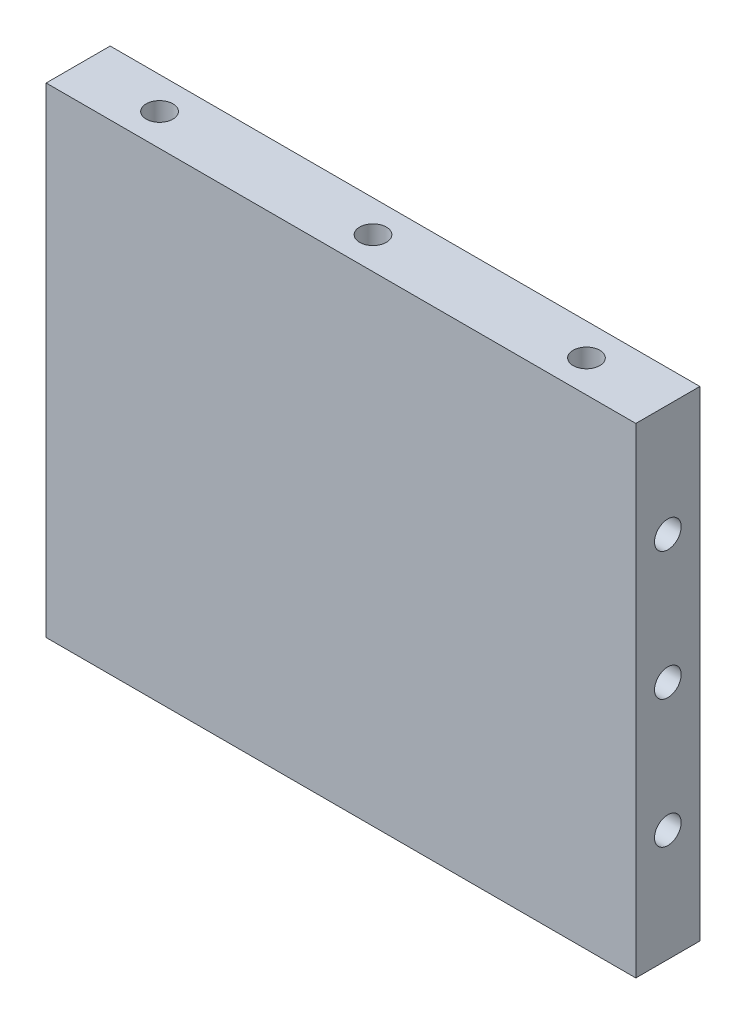
ISO-10303-21;
HEADER;
FILE_DESCRIPTION(('STEP AP214'),'2;1');
FILE_NAME('part.step','',(''),(''),'','','');
FILE_SCHEMA(('AUTOMOTIVE_DESIGN { 1 0 10303 214 1 1 1 1 }'));
ENDSEC;
DATA;
#1=APPLICATION_CONTEXT('core data for automotive mechanical design processes');
#2=APPLICATION_PROTOCOL_DEFINITION('international standard','automotive_design',2000,#1);
#3=PRODUCT_CONTEXT('',#1,'mechanical');
#4=PRODUCT('Part','Part','',(#3));
#5=PRODUCT_RELATED_PRODUCT_CATEGORY('part','',(#4));
#6=PRODUCT_DEFINITION_FORMATION('','',#4);
#7=PRODUCT_DEFINITION_CONTEXT('part definition',#1,'design');
#8=PRODUCT_DEFINITION('design','',#6,#7);
#9=PRODUCT_DEFINITION_SHAPE('','',#8);
#10=(LENGTH_UNIT() NAMED_UNIT(*) SI_UNIT(.MILLI.,.METRE.));
#11=(NAMED_UNIT(*) PLANE_ANGLE_UNIT() SI_UNIT($,.RADIAN.));
#12=(NAMED_UNIT(*) SI_UNIT($,.STERADIAN.) SOLID_ANGLE_UNIT());
#13=UNCERTAINTY_MEASURE_WITH_UNIT(LENGTH_MEASURE(1.E-05),#10,'distance_accuracy_value','');
#14=(GEOMETRIC_REPRESENTATION_CONTEXT(3) GLOBAL_UNCERTAINTY_ASSIGNED_CONTEXT((#13)) GLOBAL_UNIT_ASSIGNED_CONTEXT((#10,
#11,#12)) REPRESENTATION_CONTEXT('',''));
#15=CARTESIAN_POINT('',(0.,0.,0.));
#16=DIRECTION('',(0.,0.,1.));
#17=DIRECTION('',(1.,0.,0.));
#18=AXIS2_PLACEMENT_3D('',#15,#16,#17);
#19=CARTESIAN_POINT('',(20.,22.5,3.));
#20=DIRECTION('',(0.,1.,0.));
#21=DIRECTION('',(0.,0.,1.));
#22=AXIS2_PLACEMENT_3D('',#19,#20,#21);
#23=CYLINDRICAL_SURFACE('',#22,1.24999999999999);
#24=CARTESIAN_POINT('',(20.,22.5,3.));
#25=DIRECTION('',(0.,1.,0.));
#26=DIRECTION('',(0.,0.,1.));
#27=AXIS2_PLACEMENT_3D('',#24,#25,#26);
#28=CIRCLE('',#27,1.25);
#29=CARTESIAN_POINT('',(20.,22.5,4.25));
#30=VERTEX_POINT('',#29);
#31=EDGE_CURVE('E240',#30,#30,#28,.T.);
#32=ORIENTED_EDGE('',*,*,#31,.T.);
#33=EDGE_LOOP('',(#32));
#34=FACE_BOUND('',#33,.T.);
#35=CARTESIAN_POINT('',(20.,12.,3.));
#36=DIRECTION('',(0.707106781186547,0.707106781186547,0.));
#37=DIRECTION('',(-0.707106781186547,0.707106781186547,0.));
#38=AXIS2_PLACEMENT_3D('',#35,#36,#37);
#39=ELLIPSE('',#38,1.76776695296636,1.24999999999999);
#40=CARTESIAN_POINT('',(20.,12.,4.24999999999999));
#41=VERTEX_POINT('',#40);
#42=CARTESIAN_POINT('',(20.,12.,1.75000000000001));
#43=VERTEX_POINT('',#42);
#44=EDGE_CURVE('E60',#41,#43,#39,.F.);
#45=ORIENTED_EDGE('',*,*,#44,.T.);
#46=CARTESIAN_POINT('',(20.,12.,3.));
#47=DIRECTION('',(-0.707106781186547,0.707106781186547,0.));
#48=DIRECTION('',(0.707106781186547,0.707106781186547,0.));
#49=AXIS2_PLACEMENT_3D('',#46,#47,#48);
#50=ELLIPSE('',#49,1.76776695296636,1.24999999999999);
#51=EDGE_CURVE('E336',#43,#41,#50,.F.);
#52=ORIENTED_EDGE('',*,*,#51,.T.);
#53=EDGE_LOOP('',(#45,#52));
#54=FACE_BOUND('',#53,.T.);
#55=ADVANCED_FACE('F45',(#34,#54),#23,.F.);
#56=CARTESIAN_POINT('',(-20.,22.5,3.));
#57=DIRECTION('',(0.,1.,0.));
#58=DIRECTION('',(0.,0.,1.));
#59=AXIS2_PLACEMENT_3D('',#56,#57,#58);
#60=CYLINDRICAL_SURFACE('',#59,1.24999999999999);
#61=CARTESIAN_POINT('',(-20.,22.5,3.));
#62=DIRECTION('',(0.,1.,0.));
#63=DIRECTION('',(0.,0.,1.));
#64=AXIS2_PLACEMENT_3D('',#61,#62,#63);
#65=CIRCLE('',#64,1.25);
#66=CARTESIAN_POINT('',(-20.,22.5,4.25));
#67=VERTEX_POINT('',#66);
#68=EDGE_CURVE('E256',#67,#67,#65,.T.);
#69=ORIENTED_EDGE('',*,*,#68,.T.);
#70=EDGE_LOOP('',(#69));
#71=FACE_BOUND('',#70,.T.);
#72=CARTESIAN_POINT('',(-20.,12.,3.));
#73=DIRECTION('',(0.707106781186547,0.707106781186547,0.));
#74=DIRECTION('',(-0.707106781186547,0.707106781186547,0.));
#75=AXIS2_PLACEMENT_3D('',#72,#73,#74);
#76=ELLIPSE('',#75,1.76776695296636,1.24999999999999);
#77=CARTESIAN_POINT('',(-20.,12.,4.24999999999999));
#78=VERTEX_POINT('',#77);
#79=CARTESIAN_POINT('',(-20.,12.,1.75000000000001));
#80=VERTEX_POINT('',#79);
#81=EDGE_CURVE('E67',#78,#80,#76,.F.);
#82=ORIENTED_EDGE('',*,*,#81,.T.);
#83=CARTESIAN_POINT('',(-20.,12.,3.));
#84=DIRECTION('',(-0.707106781186547,0.707106781186547,0.));
#85=DIRECTION('',(0.707106781186547,0.707106781186547,0.));
#86=AXIS2_PLACEMENT_3D('',#83,#84,#85);
#87=ELLIPSE('',#86,1.76776695296636,1.24999999999999);
#88=EDGE_CURVE('E349',#80,#78,#87,.F.);
#89=ORIENTED_EDGE('',*,*,#88,.T.);
#90=EDGE_LOOP('',(#82,#89));
#91=FACE_BOUND('',#90,.T.);
#92=ADVANCED_FACE('F411',(#71,#91),#60,.F.);
#93=CARTESIAN_POINT('',(0.,22.5,3.));
#94=DIRECTION('',(0.,1.,0.));
#95=DIRECTION('',(0.,0.,1.));
#96=AXIS2_PLACEMENT_3D('',#93,#94,#95);
#97=CYLINDRICAL_SURFACE('',#96,1.24999999999999);
#98=CARTESIAN_POINT('',(0.,22.5,3.));
#99=DIRECTION('',(0.,1.,0.));
#100=DIRECTION('',(0.,0.,1.));
#101=AXIS2_PLACEMENT_3D('',#98,#99,#100);
#102=CIRCLE('',#101,1.25);
#103=CARTESIAN_POINT('',(0.,22.5,4.25));
#104=VERTEX_POINT('',#103);
#105=EDGE_CURVE('E248',#104,#104,#102,.T.);
#106=ORIENTED_EDGE('',*,*,#105,.T.);
#107=EDGE_LOOP('',(#106));
#108=FACE_BOUND('',#107,.T.);
#109=CARTESIAN_POINT('',(0.,12.,3.));
#110=DIRECTION('',(0.707106781186547,0.707106781186547,0.));
#111=DIRECTION('',(-0.707106781186547,0.707106781186547,0.));
#112=AXIS2_PLACEMENT_3D('',#109,#110,#111);
#113=ELLIPSE('',#112,1.76776695296636,1.24999999999999);
#114=CARTESIAN_POINT('',(0.,12.,4.24999999999999));
#115=VERTEX_POINT('',#114);
#116=CARTESIAN_POINT('',(0.,12.,1.75000000000001));
#117=VERTEX_POINT('',#116);
#118=EDGE_CURVE('E150',#115,#117,#113,.F.);
#119=ORIENTED_EDGE('',*,*,#118,.T.);
#120=CARTESIAN_POINT('',(0.,12.,3.));
#121=DIRECTION('',(-0.707106781186547,0.707106781186547,0.));
#122=DIRECTION('',(0.707106781186547,0.707106781186547,0.));
#123=AXIS2_PLACEMENT_3D('',#120,#121,#122);
#124=ELLIPSE('',#123,1.76776695296636,1.24999999999999);
#125=EDGE_CURVE('E11',#117,#115,#124,.F.);
#126=ORIENTED_EDGE('',*,*,#125,.T.);
#127=EDGE_LOOP('',(#119,#126));
#128=FACE_BOUND('',#127,.T.);
#129=ADVANCED_FACE('F160',(#108,#128),#97,.F.);
#130=CARTESIAN_POINT('',(0.,0.,2.99999999999648));
#131=DIRECTION('',(0.707106781186547,0.707106781186547,0.));
#132=DIRECTION('',(-0.707106781186547,0.707106781186547,0.));
#133=AXIS2_PLACEMENT_3D('',#130,#131,#132);
#134=ELLIPSE('',#133,1.76776695296636,1.24999999999999);
#135=CARTESIAN_POINT('',(0.,0.,4.24999999999647));
#136=VERTEX_POINT('',#135);
#137=CARTESIAN_POINT('',(0.,0.,1.74999999999649));
#138=VERTEX_POINT('',#137);
#139=EDGE_CURVE('E268',#136,#138,#134,.T.);
#140=ORIENTED_EDGE('',*,*,#139,.T.);
#141=CARTESIAN_POINT('',(0.,0.,2.99999999999648));
#142=DIRECTION('',(-0.707106781186547,0.707106781186547,0.));
#143=DIRECTION('',(0.707106781186547,0.707106781186547,0.));
#144=AXIS2_PLACEMENT_3D('',#141,#142,#143);
#145=ELLIPSE('',#144,1.76776695296636,1.24999999999999);
#146=EDGE_CURVE('E264',#138,#136,#145,.T.);
#147=ORIENTED_EDGE('',*,*,#146,.T.);
#148=EDGE_LOOP('',(#140,#147));
#149=FACE_BOUND('',#148,.T.);
#150=CARTESIAN_POINT('',(0.,-12.,3.));
#151=DIRECTION('',(0.707106781186547,0.707106781186547,0.));
#152=DIRECTION('',(-0.707106781186547,0.707106781186547,0.));
#153=AXIS2_PLACEMENT_3D('',#150,#151,#152);
#154=ELLIPSE('',#153,1.76776695296636,1.24999999999999);
#155=CARTESIAN_POINT('',(0.,-12.,4.24999999999999));
#156=VERTEX_POINT('',#155);
#157=CARTESIAN_POINT('',(0.,-12.,1.75000000000001));
#158=VERTEX_POINT('',#157);
#159=EDGE_CURVE('E310',#156,#158,#154,.F.);
#160=ORIENTED_EDGE('',*,*,#159,.T.);
#161=CARTESIAN_POINT('',(0.,-12.,3.));
#162=DIRECTION('',(-0.707106781186547,0.707106781186547,0.));
#163=DIRECTION('',(0.707106781186547,0.707106781186547,0.));
#164=AXIS2_PLACEMENT_3D('',#161,#162,#163);
#165=ELLIPSE('',#164,1.76776695296636,1.24999999999999);
#166=EDGE_CURVE('E298',#158,#156,#165,.F.);
#167=ORIENTED_EDGE('',*,*,#166,.T.);
#168=EDGE_LOOP('',(#160,#167));
#169=FACE_BOUND('',#168,.T.);
#170=ADVANCED_FACE('F445',(#149,#169),#97,.F.);
#171=CARTESIAN_POINT('',(-20.,0.,2.99999999999648));
#172=DIRECTION('',(0.707106781186547,0.707106781186547,0.));
#173=DIRECTION('',(-0.707106781186547,0.707106781186547,0.));
#174=AXIS2_PLACEMENT_3D('',#171,#172,#173);
#175=ELLIPSE('',#174,1.76776695296636,1.24999999999999);
#176=CARTESIAN_POINT('',(-20.,0.,4.24999999999647));
#177=VERTEX_POINT('',#176);
#178=CARTESIAN_POINT('',(-20.,0.,1.74999999999649));
#179=VERTEX_POINT('',#178);
#180=EDGE_CURVE('E187',#177,#179,#175,.T.);
#181=ORIENTED_EDGE('',*,*,#180,.T.);
#182=CARTESIAN_POINT('',(-20.,0.,2.99999999999648));
#183=DIRECTION('',(-0.707106781186547,0.707106781186547,0.));
#184=DIRECTION('',(0.707106781186547,0.707106781186547,0.));
#185=AXIS2_PLACEMENT_3D('',#182,#183,#184);
#186=ELLIPSE('',#185,1.76776695296636,1.24999999999999);
#187=EDGE_CURVE('E183',#179,#177,#186,.T.);
#188=ORIENTED_EDGE('',*,*,#187,.T.);
#189=EDGE_LOOP('',(#181,#188));
#190=FACE_BOUND('',#189,.T.);
#191=CARTESIAN_POINT('',(-20.,-12.,3.));
#192=DIRECTION('',(0.707106781186547,0.707106781186547,0.));
#193=DIRECTION('',(-0.707106781186547,0.707106781186547,0.));
#194=AXIS2_PLACEMENT_3D('',#191,#192,#193);
#195=ELLIPSE('',#194,1.76776695296636,1.24999999999999);
#196=CARTESIAN_POINT('',(-20.,-12.,4.24999999999999));
#197=VERTEX_POINT('',#196);
#198=CARTESIAN_POINT('',(-20.,-12.,1.75000000000001));
#199=VERTEX_POINT('',#198);
#200=EDGE_CURVE('E325',#197,#199,#195,.F.);
#201=ORIENTED_EDGE('',*,*,#200,.T.);
#202=CARTESIAN_POINT('',(-20.,-12.,3.));
#203=DIRECTION('',(-0.707106781186547,0.707106781186547,0.));
#204=DIRECTION('',(0.707106781186547,0.707106781186547,0.));
#205=AXIS2_PLACEMENT_3D('',#202,#203,#204);
#206=ELLIPSE('',#205,1.76776695296636,1.24999999999999);
#207=EDGE_CURVE('E313',#199,#197,#206,.F.);
#208=ORIENTED_EDGE('',*,*,#207,.T.);
#209=EDGE_LOOP('',(#201,#208));
#210=FACE_BOUND('',#209,.T.);
#211=ADVANCED_FACE('F421',(#190,#210),#60,.F.);
#212=CARTESIAN_POINT('',(20.,0.,2.99999999999648));
#213=DIRECTION('',(0.707106781186547,0.707106781186547,0.));
#214=DIRECTION('',(-0.707106781186547,0.707106781186547,0.));
#215=AXIS2_PLACEMENT_3D('',#212,#213,#214);
#216=ELLIPSE('',#215,1.76776695296636,1.24999999999999);
#217=CARTESIAN_POINT('',(20.,0.,4.24999999999647));
#218=VERTEX_POINT('',#217);
#219=CARTESIAN_POINT('',(20.,0.,1.74999999999649));
#220=VERTEX_POINT('',#219);
#221=EDGE_CURVE('E283',#218,#220,#216,.T.);
#222=ORIENTED_EDGE('',*,*,#221,.T.);
#223=CARTESIAN_POINT('',(20.,0.,2.99999999999648));
#224=DIRECTION('',(-0.707106781186547,0.707106781186547,0.));
#225=DIRECTION('',(0.707106781186547,0.707106781186547,0.));
#226=AXIS2_PLACEMENT_3D('',#223,#224,#225);
#227=ELLIPSE('',#226,1.76776695296636,1.24999999999999);
#228=EDGE_CURVE('E279',#220,#218,#227,.T.);
#229=ORIENTED_EDGE('',*,*,#228,.T.);
#230=EDGE_LOOP('',(#222,#229));
#231=FACE_BOUND('',#230,.T.);
#232=CARTESIAN_POINT('',(20.,-12.,3.));
#233=DIRECTION('',(0.707106781186547,0.707106781186547,0.));
#234=DIRECTION('',(-0.707106781186547,0.707106781186547,0.));
#235=AXIS2_PLACEMENT_3D('',#232,#233,#234);
#236=ELLIPSE('',#235,1.76776695296636,1.24999999999999);
#237=CARTESIAN_POINT('',(20.,-12.,4.24999999999999));
#238=VERTEX_POINT('',#237);
#239=CARTESIAN_POINT('',(20.,-12.,1.75000000000001));
#240=VERTEX_POINT('',#239);
#241=EDGE_CURVE('E176',#238,#240,#236,.F.);
#242=ORIENTED_EDGE('',*,*,#241,.T.);
#243=CARTESIAN_POINT('',(20.,-12.,3.));
#244=DIRECTION('',(-0.707106781186547,0.707106781186547,0.));
#245=DIRECTION('',(0.707106781186547,0.707106781186547,0.));
#246=AXIS2_PLACEMENT_3D('',#243,#244,#245);
#247=ELLIPSE('',#246,1.76776695296636,1.24999999999999);
#248=EDGE_CURVE('E158',#240,#238,#247,.F.);
#249=ORIENTED_EDGE('',*,*,#248,.T.);
#250=EDGE_LOOP('',(#242,#249));
#251=FACE_BOUND('',#250,.T.);
#252=ADVANCED_FACE('F414',(#231,#251),#23,.F.);
#253=CARTESIAN_POINT('',(0.,12.,3.));
#254=DIRECTION('',(0.707106781186547,0.707106781186547,0.));
#255=DIRECTION('',(-0.707106781186547,0.707106781186547,0.));
#256=AXIS2_PLACEMENT_3D('',#253,#254,#255);
#257=ELLIPSE('',#256,1.76776695296636,1.24999999999999);
#258=EDGE_CURVE('E143',#115,#117,#257,.T.);
#259=ORIENTED_EDGE('',*,*,#258,.T.);
#260=CARTESIAN_POINT('',(0.,12.,3.));
#261=DIRECTION('',(-0.707106781186547,0.707106781186547,0.));
#262=DIRECTION('',(0.707106781186547,0.707106781186547,0.));
#263=AXIS2_PLACEMENT_3D('',#260,#261,#262);
#264=ELLIPSE('',#263,1.76776695296636,1.24999999999999);
#265=EDGE_CURVE('E54',#117,#115,#264,.T.);
#266=ORIENTED_EDGE('',*,*,#265,.T.);
#267=EDGE_LOOP('',(#259,#266));
#268=FACE_BOUND('',#267,.T.);
#269=CARTESIAN_POINT('',(0.,0.,2.99999999999648));
#270=DIRECTION('',(0.707106781186547,0.707106781186547,0.));
#271=DIRECTION('',(-0.707106781186547,0.707106781186547,0.));
#272=AXIS2_PLACEMENT_3D('',#269,#270,#271);
#273=ELLIPSE('',#272,1.76776695296636,1.24999999999999);
#274=EDGE_CURVE('E272',#136,#138,#273,.F.);
#275=ORIENTED_EDGE('',*,*,#274,.T.);
#276=CARTESIAN_POINT('',(0.,0.,2.99999999999648));
#277=DIRECTION('',(-0.707106781186547,0.707106781186547,0.));
#278=DIRECTION('',(0.707106781186547,0.707106781186547,0.));
#279=AXIS2_PLACEMENT_3D('',#276,#277,#278);
#280=ELLIPSE('',#279,1.76776695296636,1.24999999999999);
#281=EDGE_CURVE('E260',#138,#136,#280,.F.);
#282=ORIENTED_EDGE('',*,*,#281,.T.);
#283=EDGE_LOOP('',(#275,#282));
#284=FACE_BOUND('',#283,.T.);
#285=ADVANCED_FACE('F161',(#268,#284),#97,.F.);
#286=CARTESIAN_POINT('',(20.,12.,3.));
#287=DIRECTION('',(0.707106781186547,0.707106781186547,0.));
#288=DIRECTION('',(-0.707106781186547,0.707106781186547,0.));
#289=AXIS2_PLACEMENT_3D('',#286,#287,#288);
#290=ELLIPSE('',#289,1.76776695296636,1.24999999999999);
#291=EDGE_CURVE('E343',#41,#43,#290,.T.);
#292=ORIENTED_EDGE('',*,*,#291,.T.);
#293=CARTESIAN_POINT('',(20.,12.,3.));
#294=DIRECTION('',(-0.707106781186547,0.707106781186547,0.));
#295=DIRECTION('',(0.707106781186547,0.707106781186547,0.));
#296=AXIS2_PLACEMENT_3D('',#293,#294,#295);
#297=ELLIPSE('',#296,1.76776695296636,1.24999999999999);
#298=EDGE_CURVE('E339',#43,#41,#297,.T.);
#299=ORIENTED_EDGE('',*,*,#298,.T.);
#300=EDGE_LOOP('',(#292,#299));
#301=FACE_BOUND('',#300,.T.);
#302=CARTESIAN_POINT('',(20.,0.,2.99999999999648));
#303=DIRECTION('',(0.707106781186547,0.707106781186547,0.));
#304=DIRECTION('',(-0.707106781186547,0.707106781186547,0.));
#305=AXIS2_PLACEMENT_3D('',#302,#303,#304);
#306=ELLIPSE('',#305,1.76776695296636,1.24999999999999);
#307=EDGE_CURVE('E287',#218,#220,#306,.F.);
#308=ORIENTED_EDGE('',*,*,#307,.T.);
#309=CARTESIAN_POINT('',(20.,0.,2.99999999999648));
#310=DIRECTION('',(-0.707106781186547,0.707106781186547,0.));
#311=DIRECTION('',(0.707106781186547,0.707106781186547,0.));
#312=AXIS2_PLACEMENT_3D('',#309,#310,#311);
#313=ELLIPSE('',#312,1.76776695296636,1.24999999999999);
#314=EDGE_CURVE('E275',#220,#218,#313,.F.);
#315=ORIENTED_EDGE('',*,*,#314,.T.);
#316=EDGE_LOOP('',(#308,#315));
#317=FACE_BOUND('',#316,.T.);
#318=ADVANCED_FACE('F427',(#301,#317),#23,.F.);
#319=CARTESIAN_POINT('',(-20.,12.,3.));
#320=DIRECTION('',(0.707106781186547,0.707106781186547,0.));
#321=DIRECTION('',(-0.707106781186547,0.707106781186547,0.));
#322=AXIS2_PLACEMENT_3D('',#319,#320,#321);
#323=ELLIPSE('',#322,1.76776695296636,1.24999999999999);
#324=EDGE_CURVE('E356',#78,#80,#323,.T.);
#325=ORIENTED_EDGE('',*,*,#324,.T.);
#326=CARTESIAN_POINT('',(-20.,12.,3.));
#327=DIRECTION('',(-0.707106781186547,0.707106781186547,0.));
#328=DIRECTION('',(0.707106781186547,0.707106781186547,0.));
#329=AXIS2_PLACEMENT_3D('',#326,#327,#328);
#330=ELLIPSE('',#329,1.76776695296636,1.24999999999999);
#331=EDGE_CURVE('E352',#80,#78,#330,.T.);
#332=ORIENTED_EDGE('',*,*,#331,.T.);
#333=EDGE_LOOP('',(#325,#332));
#334=FACE_BOUND('',#333,.T.);
#335=CARTESIAN_POINT('',(-20.,0.,2.99999999999648));
#336=DIRECTION('',(0.707106781186547,0.707106781186547,0.));
#337=DIRECTION('',(-0.707106781186547,0.707106781186547,0.));
#338=AXIS2_PLACEMENT_3D('',#335,#336,#337);
#339=ELLIPSE('',#338,1.76776695296636,1.24999999999999);
#340=EDGE_CURVE('E191',#177,#179,#339,.F.);
#341=ORIENTED_EDGE('',*,*,#340,.T.);
#342=CARTESIAN_POINT('',(-20.,0.,2.99999999999648));
#343=DIRECTION('',(-0.707106781186547,0.707106781186547,0.));
#344=DIRECTION('',(0.707106781186547,0.707106781186547,0.));
#345=AXIS2_PLACEMENT_3D('',#342,#343,#344);
#346=ELLIPSE('',#345,1.76776695296636,1.24999999999999);
#347=EDGE_CURVE('E179',#179,#177,#346,.F.);
#348=ORIENTED_EDGE('',*,*,#347,.T.);
#349=EDGE_LOOP('',(#341,#348));
#350=FACE_BOUND('',#349,.T.);
#351=ADVANCED_FACE('F406',(#334,#350),#60,.F.);
#352=CARTESIAN_POINT('',(27.625,-22.5,6.));
#353=DIRECTION('',(-1.,0.,0.));
#354=DIRECTION('',(0.,0.,1.));
#355=AXIS2_PLACEMENT_3D('',#352,#353,#354);
#356=PLANE('',#355);
#357=CARTESIAN_POINT('',(27.625,12.,3.));
#358=DIRECTION('',(-1.,0.,0.));
#359=DIRECTION('',(0.,0.,1.));
#360=AXIS2_PLACEMENT_3D('',#357,#358,#359);
#361=CIRCLE('',#360,1.24999999999999);
#362=CARTESIAN_POINT('',(27.625,12.,4.24999999999999));
#363=VERTEX_POINT('',#362);
#364=EDGE_CURVE('E362',#363,#363,#361,.T.);
#365=ORIENTED_EDGE('',*,*,#364,.T.);
#366=EDGE_LOOP('',(#365));
#367=FACE_BOUND('',#366,.T.);
#368=CARTESIAN_POINT('',(27.625,-12.,3.));
#369=DIRECTION('',(-1.,0.,0.));
#370=DIRECTION('',(0.,0.,1.));
#371=AXIS2_PLACEMENT_3D('',#368,#369,#370);
#372=CIRCLE('',#371,1.24999999999999);
#373=CARTESIAN_POINT('',(27.625,-12.,4.24999999999999));
#374=VERTEX_POINT('',#373);
#375=EDGE_CURVE('E328',#374,#374,#372,.T.);
#376=ORIENTED_EDGE('',*,*,#375,.T.);
#377=EDGE_LOOP('',(#376));
#378=FACE_BOUND('',#377,.T.);
#379=CARTESIAN_POINT('',(27.625,0.,2.99999999999295));
#380=DIRECTION('',(-1.,0.,0.));
#381=DIRECTION('',(0.,0.,1.));
#382=AXIS2_PLACEMENT_3D('',#379,#380,#381);
#383=CIRCLE('',#382,1.24999999999999);
#384=CARTESIAN_POINT('',(27.625,0.,4.24999999999294));
#385=VERTEX_POINT('',#384);
#386=EDGE_CURVE('E290',#385,#385,#383,.T.);
#387=ORIENTED_EDGE('',*,*,#386,.T.);
#388=EDGE_LOOP('',(#387));
#389=FACE_BOUND('',#388,.T.);
#390=DIRECTION('',(0.,1.,0.));
#391=VECTOR('',#390,1.);
#392=CARTESIAN_POINT('',(27.625,-22.5,0.));
#393=LINE('',#392,#391);
#394=CARTESIAN_POINT('',(27.625,-22.5,0.));
#395=VERTEX_POINT('',#394);
#396=CARTESIAN_POINT('',(27.625,22.5,0.));
#397=VERTEX_POINT('',#396);
#398=EDGE_CURVE('E221',#395,#397,#393,.T.);
#399=ORIENTED_EDGE('',*,*,#398,.T.);
#400=DIRECTION('',(0.,0.,-1.));
#401=VECTOR('',#400,1.);
#402=CARTESIAN_POINT('',(27.625,22.5,6.));
#403=LINE('',#402,#401);
#404=CARTESIAN_POINT('',(27.625,22.5,6.));
#405=VERTEX_POINT('',#404);
#406=EDGE_CURVE('E194',#405,#397,#403,.T.);
#407=ORIENTED_EDGE('',*,*,#406,.F.);
#408=DIRECTION('',(0.,1.,0.));
#409=VECTOR('',#408,1.);
#410=CARTESIAN_POINT('',(27.625,-22.5,6.));
#411=LINE('',#410,#409);
#412=CARTESIAN_POINT('',(27.625,-22.5,6.));
#413=VERTEX_POINT('',#412);
#414=EDGE_CURVE('E214',#413,#405,#411,.T.);
#415=ORIENTED_EDGE('',*,*,#414,.F.);
#416=DIRECTION('',(0.,0.,-1.));
#417=VECTOR('',#416,1.);
#418=CARTESIAN_POINT('',(27.625,-22.5,6.));
#419=LINE('',#418,#417);
#420=EDGE_CURVE('E206',#413,#395,#419,.T.);
#421=ORIENTED_EDGE('',*,*,#420,.T.);
#422=EDGE_LOOP('',(#399,#407,#415,#421));
#423=FACE_BOUND('',#422,.T.);
#424=ADVANCED_FACE('F47',(#367,#378,#389,#423),#356,.F.);
#425=CARTESIAN_POINT('',(-27.625,22.5,6.));
#426=DIRECTION('',(0.,-1.,0.));
#427=DIRECTION('',(0.,0.,-1.));
#428=AXIS2_PLACEMENT_3D('',#425,#426,#427);
#429=PLANE('',#428);
#430=ORIENTED_EDGE('',*,*,#68,.F.);
#431=EDGE_LOOP('',(#430));
#432=FACE_BOUND('',#431,.T.);
#433=ORIENTED_EDGE('',*,*,#105,.F.);
#434=EDGE_LOOP('',(#433));
#435=FACE_BOUND('',#434,.T.);
#436=ORIENTED_EDGE('',*,*,#31,.F.);
#437=EDGE_LOOP('',(#436));
#438=FACE_BOUND('',#437,.T.);
#439=DIRECTION('',(-1.,0.,0.));
#440=VECTOR('',#439,1.);
#441=CARTESIAN_POINT('',(-27.625,22.5,0.));
#442=LINE('',#441,#440);
#443=CARTESIAN_POINT('',(-27.625,22.5,0.));
#444=VERTEX_POINT('',#443);
#445=EDGE_CURVE('E218',#397,#444,#442,.T.);
#446=ORIENTED_EDGE('',*,*,#445,.T.);
#447=DIRECTION('',(0.,0.,-1.));
#448=VECTOR('',#447,1.);
#449=CARTESIAN_POINT('',(-27.625,22.5,6.));
#450=LINE('',#449,#448);
#451=CARTESIAN_POINT('',(-27.625,22.5,6.));
#452=VERTEX_POINT('',#451);
#453=EDGE_CURVE('E198',#452,#444,#450,.T.);
#454=ORIENTED_EDGE('',*,*,#453,.F.);
#455=DIRECTION('',(-1.,0.,0.));
#456=VECTOR('',#455,1.);
#457=CARTESIAN_POINT('',(-27.625,22.5,6.));
#458=LINE('',#457,#456);
#459=EDGE_CURVE('E231',#405,#452,#458,.T.);
#460=ORIENTED_EDGE('',*,*,#459,.F.);
#461=ORIENTED_EDGE('',*,*,#406,.T.);
#462=EDGE_LOOP('',(#446,#454,#460,#461));
#463=FACE_BOUND('',#462,.T.);
#464=ADVANCED_FACE('F378',(#432,#435,#438,#463),#429,.F.);
#465=CARTESIAN_POINT('',(-27.625,-22.5,6.));
#466=DIRECTION('',(1.,0.,0.));
#467=DIRECTION('',(0.,0.,-1.));
#468=AXIS2_PLACEMENT_3D('',#465,#466,#467);
#469=PLANE('',#468);
#470=CARTESIAN_POINT('',(-27.625,12.,3.));
#471=DIRECTION('',(-1.,0.,0.));
#472=DIRECTION('',(0.,0.,1.));
#473=AXIS2_PLACEMENT_3D('',#470,#471,#472);
#474=CIRCLE('',#473,1.24999999999999);
#475=CARTESIAN_POINT('',(-27.625,12.,4.24999999999999));
#476=VERTEX_POINT('',#475);
#477=EDGE_CURVE('E366',#476,#476,#474,.T.);
#478=ORIENTED_EDGE('',*,*,#477,.F.);
#479=EDGE_LOOP('',(#478));
#480=FACE_BOUND('',#479,.T.);
#481=CARTESIAN_POINT('',(-27.625,-12.,3.));
#482=DIRECTION('',(-1.,0.,0.));
#483=DIRECTION('',(0.,0.,1.));
#484=AXIS2_PLACEMENT_3D('',#481,#482,#483);
#485=CIRCLE('',#484,1.24999999999999);
#486=CARTESIAN_POINT('',(-27.625,-12.,4.24999999999999));
#487=VERTEX_POINT('',#486);
#488=EDGE_CURVE('E332',#487,#487,#485,.T.);
#489=ORIENTED_EDGE('',*,*,#488,.F.);
#490=EDGE_LOOP('',(#489));
#491=FACE_BOUND('',#490,.T.);
#492=CARTESIAN_POINT('',(-27.625,0.,2.99999999999295));
#493=DIRECTION('',(-1.,0.,0.));
#494=DIRECTION('',(0.,0.,1.));
#495=AXIS2_PLACEMENT_3D('',#492,#493,#494);
#496=CIRCLE('',#495,1.24999999999999);
#497=CARTESIAN_POINT('',(-27.625,0.,4.24999999999294));
#498=VERTEX_POINT('',#497);
#499=EDGE_CURVE('E294',#498,#498,#496,.T.);
#500=ORIENTED_EDGE('',*,*,#499,.F.);
#501=EDGE_LOOP('',(#500));
#502=FACE_BOUND('',#501,.T.);
#503=DIRECTION('',(0.,-1.,0.));
#504=VECTOR('',#503,1.);
#505=CARTESIAN_POINT('',(-27.625,-22.5,0.));
#506=LINE('',#505,#504);
#507=CARTESIAN_POINT('',(-27.625,-22.5,0.));
#508=VERTEX_POINT('',#507);
#509=EDGE_CURVE('E215',#444,#508,#506,.T.);
#510=ORIENTED_EDGE('',*,*,#509,.T.);
#511=DIRECTION('',(0.,0.,-1.));
#512=VECTOR('',#511,1.);
#513=CARTESIAN_POINT('',(-27.625,-22.5,6.));
#514=LINE('',#513,#512);
#515=CARTESIAN_POINT('',(-27.625,-22.5,6.));
#516=VERTEX_POINT('',#515);
#517=EDGE_CURVE('E202',#516,#508,#514,.T.);
#518=ORIENTED_EDGE('',*,*,#517,.F.);
#519=DIRECTION('',(0.,-1.,0.));
#520=VECTOR('',#519,1.);
#521=CARTESIAN_POINT('',(-27.625,-22.5,6.));
#522=LINE('',#521,#520);
#523=EDGE_CURVE('E228',#452,#516,#522,.T.);
#524=ORIENTED_EDGE('',*,*,#523,.F.);
#525=ORIENTED_EDGE('',*,*,#453,.T.);
#526=EDGE_LOOP('',(#510,#518,#524,#525));
#527=FACE_BOUND('',#526,.T.);
#528=ADVANCED_FACE('F374',(#480,#491,#502,#527),#469,.F.);
#529=CARTESIAN_POINT('',(-27.625,-22.5,6.));
#530=DIRECTION('',(0.,1.,0.));
#531=DIRECTION('',(0.,0.,1.));
#532=AXIS2_PLACEMENT_3D('',#529,#530,#531);
#533=PLANE('',#532);
#534=CARTESIAN_POINT('',(-20.,-22.5,3.));
#535=DIRECTION('',(0.,1.,0.));
#536=DIRECTION('',(0.,0.,1.));
#537=AXIS2_PLACEMENT_3D('',#534,#535,#536);
#538=CIRCLE('',#537,1.24999999999999);
#539=CARTESIAN_POINT('',(-20.,-22.5,4.24999999999999));
#540=VERTEX_POINT('',#539);
#541=EDGE_CURVE('E252',#540,#540,#538,.T.);
#542=ORIENTED_EDGE('',*,*,#541,.T.);
#543=EDGE_LOOP('',(#542));
#544=FACE_BOUND('',#543,.T.);
#545=CARTESIAN_POINT('',(0.,-22.5,3.));
#546=DIRECTION('',(0.,1.,0.));
#547=DIRECTION('',(0.,0.,1.));
#548=AXIS2_PLACEMENT_3D('',#545,#546,#547);
#549=CIRCLE('',#548,1.24999999999999);
#550=CARTESIAN_POINT('',(0.,-22.5,4.24999999999999));
#551=VERTEX_POINT('',#550);
#552=EDGE_CURVE('E244',#551,#551,#549,.T.);
#553=ORIENTED_EDGE('',*,*,#552,.T.);
#554=EDGE_LOOP('',(#553));
#555=FACE_BOUND('',#554,.T.);
#556=CARTESIAN_POINT('',(20.,-22.5,3.));
#557=DIRECTION('',(0.,1.,0.));
#558=DIRECTION('',(0.,0.,1.));
#559=AXIS2_PLACEMENT_3D('',#556,#557,#558);
#560=CIRCLE('',#559,1.24999999999999);
#561=CARTESIAN_POINT('',(20.,-22.5,4.24999999999999));
#562=VERTEX_POINT('',#561);
#563=EDGE_CURVE('E225',#562,#562,#560,.T.);
#564=ORIENTED_EDGE('',*,*,#563,.T.);
#565=EDGE_LOOP('',(#564));
#566=FACE_BOUND('',#565,.T.);
#567=DIRECTION('',(1.,0.,0.));
#568=VECTOR('',#567,1.);
#569=CARTESIAN_POINT('',(-27.625,-22.5,0.));
#570=LINE('',#569,#568);
#571=EDGE_CURVE('E211',#508,#395,#570,.T.);
#572=ORIENTED_EDGE('',*,*,#571,.T.);
#573=ORIENTED_EDGE('',*,*,#420,.F.);
#574=DIRECTION('',(1.,0.,0.));
#575=VECTOR('',#574,1.);
#576=CARTESIAN_POINT('',(-27.625,-22.5,6.));
#577=LINE('',#576,#575);
#578=EDGE_CURVE('E210',#516,#413,#577,.T.);
#579=ORIENTED_EDGE('',*,*,#578,.F.);
#580=ORIENTED_EDGE('',*,*,#517,.T.);
#581=EDGE_LOOP('',(#572,#573,#579,#580));
#582=FACE_BOUND('',#581,.T.);
#583=ADVANCED_FACE('F377',(#544,#555,#566,#582),#533,.F.);
#584=CARTESIAN_POINT('',(0.,0.,6.));
#585=DIRECTION('',(0.,0.,-1.));
#586=DIRECTION('',(-1.,0.,0.));
#587=AXIS2_PLACEMENT_3D('',#584,#585,#586);
#588=PLANE('',#587);
#589=ORIENTED_EDGE('',*,*,#414,.T.);
#590=ORIENTED_EDGE('',*,*,#459,.T.);
#591=ORIENTED_EDGE('',*,*,#523,.T.);
#592=ORIENTED_EDGE('',*,*,#578,.T.);
#593=EDGE_LOOP('',(#589,#590,#591,#592));
#594=FACE_BOUND('',#593,.T.);
#595=ADVANCED_FACE('F399',(#594),#588,.F.);
#596=CARTESIAN_POINT('',(0.,0.,0.));
#597=DIRECTION('',(0.,0.,-1.));
#598=DIRECTION('',(-1.,0.,0.));
#599=AXIS2_PLACEMENT_3D('',#596,#597,#598);
#600=PLANE('',#599);
#601=ORIENTED_EDGE('',*,*,#398,.F.);
#602=ORIENTED_EDGE('',*,*,#571,.F.);
#603=ORIENTED_EDGE('',*,*,#509,.F.);
#604=ORIENTED_EDGE('',*,*,#445,.F.);
#605=EDGE_LOOP('',(#601,#602,#603,#604));
#606=FACE_BOUND('',#605,.T.);
#607=ADVANCED_FACE('F394',(#606),#600,.T.);
#608=CARTESIAN_POINT('',(20.,-12.,3.));
#609=DIRECTION('',(0.707106781186547,0.707106781186547,0.));
#610=DIRECTION('',(-0.707106781186547,0.707106781186547,0.));
#611=AXIS2_PLACEMENT_3D('',#608,#609,#610);
#612=ELLIPSE('',#611,1.76776695296636,1.24999999999999);
#613=EDGE_CURVE('E172',#238,#240,#612,.T.);
#614=ORIENTED_EDGE('',*,*,#613,.T.);
#615=CARTESIAN_POINT('',(20.,-12.,3.));
#616=DIRECTION('',(-0.707106781186547,0.707106781186547,0.));
#617=DIRECTION('',(0.707106781186547,0.707106781186547,0.));
#618=AXIS2_PLACEMENT_3D('',#615,#616,#617);
#619=ELLIPSE('',#618,1.76776695296636,1.24999999999999);
#620=EDGE_CURVE('E168',#240,#238,#619,.T.);
#621=ORIENTED_EDGE('',*,*,#620,.T.);
#622=EDGE_LOOP('',(#614,#621));
#623=FACE_BOUND('',#622,.T.);
#624=ORIENTED_EDGE('',*,*,#563,.F.);
#625=EDGE_LOOP('',(#624));
#626=FACE_BOUND('',#625,.T.);
#627=ADVANCED_FACE('F415',(#623,#626),#23,.F.);
#628=CARTESIAN_POINT('',(0.,-12.,3.));
#629=DIRECTION('',(0.707106781186547,0.707106781186547,0.));
#630=DIRECTION('',(-0.707106781186547,0.707106781186547,0.));
#631=AXIS2_PLACEMENT_3D('',#628,#629,#630);
#632=ELLIPSE('',#631,1.76776695296636,1.24999999999999);
#633=EDGE_CURVE('E306',#156,#158,#632,.T.);
#634=ORIENTED_EDGE('',*,*,#633,.T.);
#635=CARTESIAN_POINT('',(0.,-12.,3.));
#636=DIRECTION('',(-0.707106781186547,0.707106781186547,0.));
#637=DIRECTION('',(0.707106781186547,0.707106781186547,0.));
#638=AXIS2_PLACEMENT_3D('',#635,#636,#637);
#639=ELLIPSE('',#638,1.76776695296636,1.24999999999999);
#640=EDGE_CURVE('E302',#158,#156,#639,.T.);
#641=ORIENTED_EDGE('',*,*,#640,.T.);
#642=EDGE_LOOP('',(#634,#641));
#643=FACE_BOUND('',#642,.T.);
#644=ORIENTED_EDGE('',*,*,#552,.F.);
#645=EDGE_LOOP('',(#644));
#646=FACE_BOUND('',#645,.T.);
#647=ADVANCED_FACE('F429',(#643,#646),#97,.F.);
#648=CARTESIAN_POINT('',(-20.,-12.,3.));
#649=DIRECTION('',(0.707106781186547,0.707106781186547,0.));
#650=DIRECTION('',(-0.707106781186547,0.707106781186547,0.));
#651=AXIS2_PLACEMENT_3D('',#648,#649,#650);
#652=ELLIPSE('',#651,1.76776695296636,1.24999999999999);
#653=EDGE_CURVE('E321',#197,#199,#652,.T.);
#654=ORIENTED_EDGE('',*,*,#653,.T.);
#655=CARTESIAN_POINT('',(-20.,-12.,3.));
#656=DIRECTION('',(-0.707106781186547,0.707106781186547,0.));
#657=DIRECTION('',(0.707106781186547,0.707106781186547,0.));
#658=AXIS2_PLACEMENT_3D('',#655,#656,#657);
#659=ELLIPSE('',#658,1.76776695296636,1.24999999999999);
#660=EDGE_CURVE('E317',#199,#197,#659,.T.);
#661=ORIENTED_EDGE('',*,*,#660,.T.);
#662=EDGE_LOOP('',(#654,#661));
#663=FACE_BOUND('',#662,.T.);
#664=ORIENTED_EDGE('',*,*,#541,.F.);
#665=EDGE_LOOP('',(#664));
#666=FACE_BOUND('',#665,.T.);
#667=ADVANCED_FACE('F422',(#663,#666),#60,.F.);
#668=CARTESIAN_POINT('',(-27.625,0.,2.99999999999295));
#669=DIRECTION('',(-1.,0.,0.));
#670=DIRECTION('',(0.,0.,1.));
#671=AXIS2_PLACEMENT_3D('',#668,#669,#670);
#672=CYLINDRICAL_SURFACE('',#671,1.24999999999999);
#673=ORIENTED_EDGE('',*,*,#499,.T.);
#674=EDGE_LOOP('',(#673));
#675=FACE_BOUND('',#674,.T.);
#676=ORIENTED_EDGE('',*,*,#340,.F.);
#677=ORIENTED_EDGE('',*,*,#187,.F.);
#678=EDGE_LOOP('',(#676,#677));
#679=FACE_BOUND('',#678,.T.);
#680=ADVANCED_FACE('F480',(#675,#679),#672,.F.);
#681=ORIENTED_EDGE('',*,*,#307,.F.);
#682=ORIENTED_EDGE('',*,*,#228,.F.);
#683=EDGE_LOOP('',(#681,#682));
#684=FACE_BOUND('',#683,.T.);
#685=ORIENTED_EDGE('',*,*,#139,.F.);
#686=ORIENTED_EDGE('',*,*,#281,.F.);
#687=EDGE_LOOP('',(#685,#686));
#688=FACE_BOUND('',#687,.T.);
#689=ADVANCED_FACE('F451',(#684,#688),#672,.F.);
#690=ORIENTED_EDGE('',*,*,#180,.F.);
#691=ORIENTED_EDGE('',*,*,#347,.F.);
#692=EDGE_LOOP('',(#690,#691));
#693=FACE_BOUND('',#692,.T.);
#694=ORIENTED_EDGE('',*,*,#274,.F.);
#695=ORIENTED_EDGE('',*,*,#146,.F.);
#696=EDGE_LOOP('',(#694,#695));
#697=FACE_BOUND('',#696,.T.);
#698=ADVANCED_FACE('F479',(#693,#697),#672,.F.);
#699=ORIENTED_EDGE('',*,*,#386,.F.);
#700=EDGE_LOOP('',(#699));
#701=FACE_BOUND('',#700,.T.);
#702=ORIENTED_EDGE('',*,*,#221,.F.);
#703=ORIENTED_EDGE('',*,*,#314,.F.);
#704=EDGE_LOOP('',(#702,#703));
#705=FACE_BOUND('',#704,.T.);
#706=ADVANCED_FACE('F454',(#701,#705),#672,.F.);
#707=CARTESIAN_POINT('',(-27.625,-12.,3.));
#708=DIRECTION('',(-1.,0.,0.));
#709=DIRECTION('',(0.,0.,1.));
#710=AXIS2_PLACEMENT_3D('',#707,#708,#709);
#711=CYLINDRICAL_SURFACE('',#710,1.24999999999999);
#712=ORIENTED_EDGE('',*,*,#241,.F.);
#713=ORIENTED_EDGE('',*,*,#620,.F.);
#714=EDGE_LOOP('',(#712,#713));
#715=FACE_BOUND('',#714,.T.);
#716=ORIENTED_EDGE('',*,*,#633,.F.);
#717=ORIENTED_EDGE('',*,*,#166,.F.);
#718=EDGE_LOOP('',(#716,#717));
#719=FACE_BOUND('',#718,.T.);
#720=ADVANCED_FACE('F460',(#715,#719),#711,.F.);
#721=ORIENTED_EDGE('',*,*,#375,.F.);
#722=EDGE_LOOP('',(#721));
#723=FACE_BOUND('',#722,.T.);
#724=ORIENTED_EDGE('',*,*,#613,.F.);
#725=ORIENTED_EDGE('',*,*,#248,.F.);
#726=EDGE_LOOP('',(#724,#725));
#727=FACE_BOUND('',#726,.T.);
#728=ADVANCED_FACE('F463',(#723,#727),#711,.F.);
#729=ORIENTED_EDGE('',*,*,#488,.T.);
#730=EDGE_LOOP('',(#729));
#731=FACE_BOUND('',#730,.T.);
#732=ORIENTED_EDGE('',*,*,#200,.F.);
#733=ORIENTED_EDGE('',*,*,#660,.F.);
#734=EDGE_LOOP('',(#732,#733));
#735=FACE_BOUND('',#734,.T.);
#736=ADVANCED_FACE('F465',(#731,#735),#711,.F.);
#737=ORIENTED_EDGE('',*,*,#653,.F.);
#738=ORIENTED_EDGE('',*,*,#207,.F.);
#739=EDGE_LOOP('',(#737,#738));
#740=FACE_BOUND('',#739,.T.);
#741=ORIENTED_EDGE('',*,*,#159,.F.);
#742=ORIENTED_EDGE('',*,*,#640,.F.);
#743=EDGE_LOOP('',(#741,#742));
#744=FACE_BOUND('',#743,.T.);
#745=ADVANCED_FACE('F472',(#740,#744),#711,.F.);
#746=CARTESIAN_POINT('',(-27.625,12.,3.));
#747=DIRECTION('',(-1.,0.,0.));
#748=DIRECTION('',(0.,0.,1.));
#749=AXIS2_PLACEMENT_3D('',#746,#747,#748);
#750=CYLINDRICAL_SURFACE('',#749,1.24999999999999);
#751=ORIENTED_EDGE('',*,*,#118,.F.);
#752=ORIENTED_EDGE('',*,*,#265,.F.);
#753=EDGE_LOOP('',(#751,#752));
#754=FACE_BOUND('',#753,.T.);
#755=ORIENTED_EDGE('',*,*,#324,.F.);
#756=ORIENTED_EDGE('',*,*,#88,.F.);
#757=EDGE_LOOP('',(#755,#756));
#758=FACE_BOUND('',#757,.T.);
#759=ADVANCED_FACE('F154',(#754,#758),#750,.F.);
#760=ORIENTED_EDGE('',*,*,#477,.T.);
#761=EDGE_LOOP('',(#760));
#762=FACE_BOUND('',#761,.T.);
#763=ORIENTED_EDGE('',*,*,#81,.F.);
#764=ORIENTED_EDGE('',*,*,#331,.F.);
#765=EDGE_LOOP('',(#763,#764));
#766=FACE_BOUND('',#765,.T.);
#767=ADVANCED_FACE('F371',(#762,#766),#750,.F.);
#768=ORIENTED_EDGE('',*,*,#258,.F.);
#769=ORIENTED_EDGE('',*,*,#125,.F.);
#770=EDGE_LOOP('',(#768,#769));
#771=FACE_BOUND('',#770,.T.);
#772=ORIENTED_EDGE('',*,*,#44,.F.);
#773=ORIENTED_EDGE('',*,*,#298,.F.);
#774=EDGE_LOOP('',(#772,#773));
#775=FACE_BOUND('',#774,.T.);
#776=ADVANCED_FACE('F145',(#771,#775),#750,.F.);
#777=ORIENTED_EDGE('',*,*,#364,.F.);
#778=EDGE_LOOP('',(#777));
#779=FACE_BOUND('',#778,.T.);
#780=ORIENTED_EDGE('',*,*,#291,.F.);
#781=ORIENTED_EDGE('',*,*,#51,.F.);
#782=EDGE_LOOP('',(#780,#781));
#783=FACE_BOUND('',#782,.T.);
#784=ADVANCED_FACE('F477',(#779,#783),#750,.F.);
#785=CLOSED_SHELL('',(#55,#92,#129,#170,#211,#252,#285,#318,#351,#424,#464,#528,#583,#595,#607,
#627,#647,#667,#680,#689,#698,#706,#720,#728,#736,#745,#759,#767,#776,#784));
#786=MANIFOLD_SOLID_BREP('B2',#785);
#787=ADVANCED_BREP_SHAPE_REPRESENTATION('',(#18,#786),#14);
#788=SHAPE_DEFINITION_REPRESENTATION(#9,#787);
ENDSEC;
END-ISO-10303-21;
